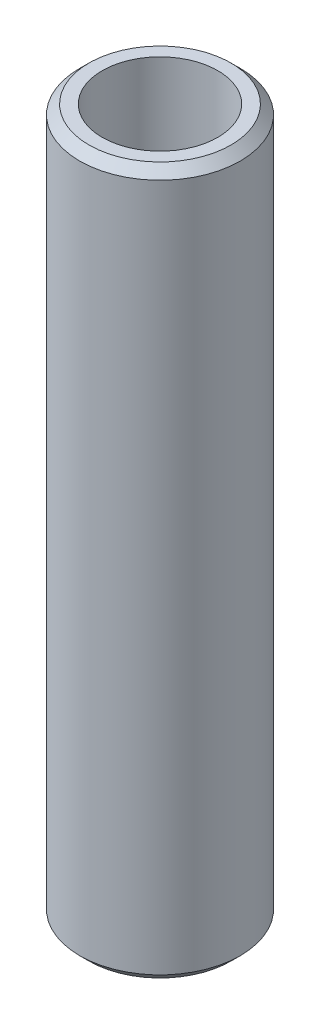
ISO-10303-21;
HEADER;
FILE_DESCRIPTION(('STEP AP214'),'2;1');
FILE_NAME('part.step','',(''),(''),'','','');
FILE_SCHEMA(('AUTOMOTIVE_DESIGN { 1 0 10303 214 1 1 1 1 }'));
ENDSEC;
DATA;
#1=APPLICATION_CONTEXT('core data for automotive mechanical design processes');
#2=APPLICATION_PROTOCOL_DEFINITION('international standard','automotive_design',2000,#1);
#3=PRODUCT_CONTEXT('',#1,'mechanical');
#4=PRODUCT('Part','Part','',(#3));
#5=PRODUCT_RELATED_PRODUCT_CATEGORY('part','',(#4));
#6=PRODUCT_DEFINITION_FORMATION('','',#4);
#7=PRODUCT_DEFINITION_CONTEXT('part definition',#1,'design');
#8=PRODUCT_DEFINITION('design','',#6,#7);
#9=PRODUCT_DEFINITION_SHAPE('','',#8);
#10=(LENGTH_UNIT() NAMED_UNIT(*) SI_UNIT(.MILLI.,.METRE.));
#11=(NAMED_UNIT(*) PLANE_ANGLE_UNIT() SI_UNIT($,.RADIAN.));
#12=(NAMED_UNIT(*) SI_UNIT($,.STERADIAN.) SOLID_ANGLE_UNIT());
#13=UNCERTAINTY_MEASURE_WITH_UNIT(LENGTH_MEASURE(1.E-05),#10,'distance_accuracy_value','');
#14=(GEOMETRIC_REPRESENTATION_CONTEXT(3) GLOBAL_UNCERTAINTY_ASSIGNED_CONTEXT((#13)) GLOBAL_UNIT_ASSIGNED_CONTEXT((#10,
#11,#12)) REPRESENTATION_CONTEXT('',''));
#15=CARTESIAN_POINT('',(0.,0.,0.));
#16=DIRECTION('',(0.,0.,1.));
#17=DIRECTION('',(1.,0.,0.));
#18=AXIS2_PLACEMENT_3D('',#15,#16,#17);
#19=CARTESIAN_POINT('',(0.,264.016407433655,0.));
#20=DIRECTION('',(0.,-1.,0.));
#21=DIRECTION('',(0.,0.,-1.));
#22=AXIS2_PLACEMENT_3D('',#19,#20,#21);
#23=CYLINDRICAL_SURFACE('',#22,30.);
#24=CARTESIAN_POINT('',(0.,260.556004411639,0.));
#25=DIRECTION('',(0.,1.,0.));
#26=DIRECTION('',(0.,0.,1.));
#27=AXIS2_PLACEMENT_3D('',#24,#25,#26);
#28=CIRCLE('',#27,30.);
#29=CARTESIAN_POINT('',(0.,260.556004411639,30.));
#30=VERTEX_POINT('',#29);
#31=EDGE_CURVE('E50',#30,#30,#28,.F.);
#32=ORIENTED_EDGE('',*,*,#31,.T.);
#33=EDGE_LOOP('',(#32));
#34=FACE_BOUND('',#33,.T.);
#35=CARTESIAN_POINT('',(0.,3.46040302201589,0.));
#36=DIRECTION('',(0.,1.,0.));
#37=DIRECTION('',(0.,0.,1.));
#38=AXIS2_PLACEMENT_3D('',#35,#36,#37);
#39=CIRCLE('',#38,30.);
#40=CARTESIAN_POINT('',(0.,3.46040302201589,30.));
#41=VERTEX_POINT('',#40);
#42=EDGE_CURVE('E51',#41,#41,#39,.T.);
#43=ORIENTED_EDGE('',*,*,#42,.T.);
#44=EDGE_LOOP('',(#43));
#45=FACE_BOUND('',#44,.T.);
#46=ADVANCED_FACE('F39',(#34,#45),#23,.T.);
#47=CARTESIAN_POINT('',(0.,264.016407433655,0.));
#48=DIRECTION('',(0.,1.,0.));
#49=DIRECTION('',(0.,0.,1.));
#50=AXIS2_PLACEMENT_3D('',#47,#48,#49);
#51=PLANE('',#50);
#52=CARTESIAN_POINT('',(0.,264.016407433655,0.));
#53=DIRECTION('',(0.,1.,0.));
#54=DIRECTION('',(0.,0.,1.));
#55=AXIS2_PLACEMENT_3D('',#52,#53,#54);
#56=CIRCLE('',#55,26.5395969779841);
#57=CARTESIAN_POINT('',(0.,264.016407433655,26.5395969779841));
#58=VERTEX_POINT('',#57);
#59=EDGE_CURVE('E54',#58,#58,#56,.T.);
#60=ORIENTED_EDGE('',*,*,#59,.T.);
#61=EDGE_LOOP('',(#60));
#62=FACE_BOUND('',#61,.T.);
#63=CARTESIAN_POINT('',(0.,264.016407433655,0.));
#64=DIRECTION('',(0.,1.,0.));
#65=DIRECTION('',(0.,0.,1.));
#66=AXIS2_PLACEMENT_3D('',#63,#64,#65);
#67=CIRCLE('',#66,21.5935933364572);
#68=CARTESIAN_POINT('',(0.,264.016407433655,21.5935933364572));
#69=VERTEX_POINT('',#68);
#70=EDGE_CURVE('E58',#69,#69,#67,.T.);
#71=ORIENTED_EDGE('',*,*,#70,.F.);
#72=EDGE_LOOP('',(#71));
#73=FACE_BOUND('',#72,.T.);
#74=ADVANCED_FACE('F69',(#62,#73),#51,.T.);
#75=CARTESIAN_POINT('',(0.,0.,0.));
#76=DIRECTION('',(0.,1.,0.));
#77=DIRECTION('',(0.,0.,1.));
#78=AXIS2_PLACEMENT_3D('',#75,#76,#77);
#79=PLANE('',#78);
#80=CARTESIAN_POINT('',(0.,0.,0.));
#81=DIRECTION('',(0.,1.,0.));
#82=DIRECTION('',(0.,0.,1.));
#83=AXIS2_PLACEMENT_3D('',#80,#81,#82);
#84=CIRCLE('',#83,26.5395969779841);
#85=CARTESIAN_POINT('',(0.,0.,26.5395969779841));
#86=VERTEX_POINT('',#85);
#87=EDGE_CURVE('E10',#86,#86,#84,.F.);
#88=ORIENTED_EDGE('',*,*,#87,.T.);
#89=EDGE_LOOP('',(#88));
#90=FACE_BOUND('',#89,.T.);
#91=CARTESIAN_POINT('',(0.,0.,0.));
#92=DIRECTION('',(0.,1.,0.));
#93=DIRECTION('',(0.,0.,1.));
#94=AXIS2_PLACEMENT_3D('',#91,#92,#93);
#95=CIRCLE('',#94,21.5935933364572);
#96=CARTESIAN_POINT('',(0.,0.,21.5935933364572));
#97=VERTEX_POINT('',#96);
#98=EDGE_CURVE('E63',#97,#97,#95,.T.);
#99=ORIENTED_EDGE('',*,*,#98,.T.);
#100=EDGE_LOOP('',(#99));
#101=FACE_BOUND('',#100,.T.);
#102=ADVANCED_FACE('F75',(#90,#101),#79,.F.);
#103=CARTESIAN_POINT('',(0.,264.016407433655,0.));
#104=DIRECTION('',(0.,-1.,0.));
#105=DIRECTION('',(0.,0.,-1.));
#106=AXIS2_PLACEMENT_3D('',#103,#104,#105);
#107=CYLINDRICAL_SURFACE('',#106,21.5935933364572);
#108=ORIENTED_EDGE('',*,*,#70,.T.);
#109=EDGE_LOOP('',(#108));
#110=FACE_BOUND('',#109,.T.);
#111=ORIENTED_EDGE('',*,*,#98,.F.);
#112=EDGE_LOOP('',(#111));
#113=FACE_BOUND('',#112,.T.);
#114=ADVANCED_FACE('F70',(#110,#113),#107,.F.);
#115=CARTESIAN_POINT('',(0.,264.016407433655,0.));
#116=DIRECTION('',(0.,-1.,0.));
#117=DIRECTION('',(0.,0.,-1.));
#118=AXIS2_PLACEMENT_3D('',#115,#116,#117);
#119=CONICAL_SURFACE('',#118,26.5395969779841,0.785398163397432);
#120=ORIENTED_EDGE('',*,*,#31,.F.);
#121=EDGE_LOOP('',(#120));
#122=FACE_BOUND('',#121,.T.);
#123=ORIENTED_EDGE('',*,*,#59,.F.);
#124=EDGE_LOOP('',(#123));
#125=FACE_BOUND('',#124,.T.);
#126=ADVANCED_FACE('F81',(#122,#125),#119,.T.);
#127=CARTESIAN_POINT('',(0.,3.46040302201589,0.));
#128=DIRECTION('',(0.,1.,0.));
#129=DIRECTION('',(0.,0.,1.));
#130=AXIS2_PLACEMENT_3D('',#127,#128,#129);
#131=CONICAL_SURFACE('',#130,30.,0.785398163397452);
#132=ORIENTED_EDGE('',*,*,#87,.F.);
#133=EDGE_LOOP('',(#132));
#134=FACE_BOUND('',#133,.T.);
#135=ORIENTED_EDGE('',*,*,#42,.F.);
#136=EDGE_LOOP('',(#135));
#137=FACE_BOUND('',#136,.T.);
#138=ADVANCED_FACE('F45',(#134,#137),#131,.T.);
#139=CLOSED_SHELL('',(#46,#74,#102,#114,#126,#138));
#140=MANIFOLD_SOLID_BREP('B2',#139);
#141=ADVANCED_BREP_SHAPE_REPRESENTATION('',(#18,#140),#14);
#142=SHAPE_DEFINITION_REPRESENTATION(#9,#141);
ENDSEC;
END-ISO-10303-21;
